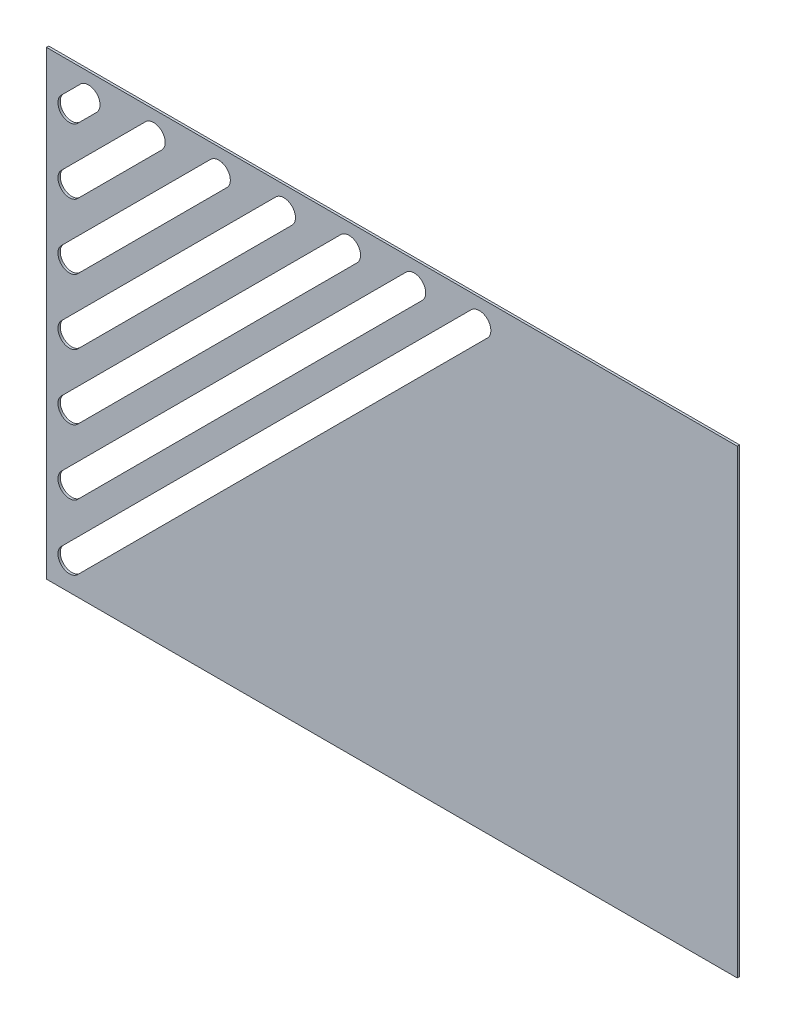
ISO-10303-21;
HEADER;
FILE_DESCRIPTION(('STEP AP214'),'2;1');
FILE_NAME('part.step','',(''),(''),'','','');
FILE_SCHEMA(('AUTOMOTIVE_DESIGN { 1 0 10303 214 1 1 1 1 }'));
ENDSEC;
DATA;
#1=APPLICATION_CONTEXT('core data for automotive mechanical design processes');
#2=APPLICATION_PROTOCOL_DEFINITION('international standard','automotive_design',2000,#1);
#3=PRODUCT_CONTEXT('',#1,'mechanical');
#4=PRODUCT('Part','Part','',(#3));
#5=PRODUCT_RELATED_PRODUCT_CATEGORY('part','',(#4));
#6=PRODUCT_DEFINITION_FORMATION('','',#4);
#7=PRODUCT_DEFINITION_CONTEXT('part definition',#1,'design');
#8=PRODUCT_DEFINITION('design','',#6,#7);
#9=PRODUCT_DEFINITION_SHAPE('','',#8);
#10=(LENGTH_UNIT() NAMED_UNIT(*) SI_UNIT(.MILLI.,.METRE.));
#11=(NAMED_UNIT(*) PLANE_ANGLE_UNIT() SI_UNIT($,.RADIAN.));
#12=(NAMED_UNIT(*) SI_UNIT($,.STERADIAN.) SOLID_ANGLE_UNIT());
#13=UNCERTAINTY_MEASURE_WITH_UNIT(LENGTH_MEASURE(1.E-05),#10,'distance_accuracy_value','');
#14=(GEOMETRIC_REPRESENTATION_CONTEXT(3) GLOBAL_UNCERTAINTY_ASSIGNED_CONTEXT((#13)) GLOBAL_UNIT_ASSIGNED_CONTEXT((#10,
#11,#12)) REPRESENTATION_CONTEXT('',''));
#15=CARTESIAN_POINT('',(0.,0.,0.));
#16=DIRECTION('',(0.,0.,1.));
#17=DIRECTION('',(1.,0.,0.));
#18=AXIS2_PLACEMENT_3D('',#15,#16,#17);
#19=CARTESIAN_POINT('',(0.,0.,-1.));
#20=DIRECTION('',(-1.,0.,0.));
#21=DIRECTION('',(0.,0.,1.));
#22=AXIS2_PLACEMENT_3D('',#19,#20,#21);
#23=PLANE('',#22);
#24=DIRECTION('',(0.,-1.,0.));
#25=VECTOR('',#24,1.);
#26=CARTESIAN_POINT('',(0.,0.,0.));
#27=LINE('',#26,#25);
#28=CARTESIAN_POINT('',(0.,200.,0.));
#29=VERTEX_POINT('',#28);
#30=CARTESIAN_POINT('',(0.,0.,0.));
#31=VERTEX_POINT('',#30);
#32=EDGE_CURVE('E453',#29,#31,#27,.T.);
#33=ORIENTED_EDGE('',*,*,#32,.F.);
#34=DIRECTION('',(0.,0.,1.));
#35=VECTOR('',#34,1.);
#36=CARTESIAN_POINT('',(0.,200.,-1.));
#37=LINE('',#36,#35);
#38=CARTESIAN_POINT('',(0.,200.,-1.));
#39=VERTEX_POINT('',#38);
#40=EDGE_CURVE('E11',#39,#29,#37,.T.);
#41=ORIENTED_EDGE('',*,*,#40,.F.);
#42=DIRECTION('',(0.,-1.,0.));
#43=VECTOR('',#42,1.);
#44=CARTESIAN_POINT('',(0.,0.,-1.));
#45=LINE('',#44,#43);
#46=CARTESIAN_POINT('',(0.,0.,-1.));
#47=VERTEX_POINT('',#46);
#48=EDGE_CURVE('E454',#39,#47,#45,.T.);
#49=ORIENTED_EDGE('',*,*,#48,.T.);
#50=DIRECTION('',(0.,0.,1.));
#51=VECTOR('',#50,1.);
#52=CARTESIAN_POINT('',(0.,0.,-1.));
#53=LINE('',#52,#51);
#54=EDGE_CURVE('E38',#47,#31,#53,.T.);
#55=ORIENTED_EDGE('',*,*,#54,.T.);
#56=EDGE_LOOP('',(#33,#41,#49,#55));
#57=FACE_BOUND('',#56,.T.);
#58=ADVANCED_FACE('F35',(#57),#23,.T.);
#59=CARTESIAN_POINT('',(0.,200.,-1.));
#60=DIRECTION('',(0.,1.,0.));
#61=DIRECTION('',(0.,0.,1.));
#62=AXIS2_PLACEMENT_3D('',#59,#60,#61);
#63=PLANE('',#62);
#64=DIRECTION('',(-1.,0.,0.));
#65=VECTOR('',#64,1.);
#66=CARTESIAN_POINT('',(0.,200.,0.));
#67=LINE('',#66,#65);
#68=CARTESIAN_POINT('',(300.,200.,0.));
#69=VERTEX_POINT('',#68);
#70=EDGE_CURVE('E458',#69,#29,#67,.T.);
#71=ORIENTED_EDGE('',*,*,#70,.F.);
#72=DIRECTION('',(0.,0.,1.));
#73=VECTOR('',#72,1.);
#74=CARTESIAN_POINT('',(300.,200.,-1.));
#75=LINE('',#74,#73);
#76=CARTESIAN_POINT('',(300.,200.,-1.));
#77=VERTEX_POINT('',#76);
#78=EDGE_CURVE('E43',#77,#69,#75,.T.);
#79=ORIENTED_EDGE('',*,*,#78,.F.);
#80=DIRECTION('',(-1.,0.,0.));
#81=VECTOR('',#80,1.);
#82=CARTESIAN_POINT('',(0.,200.,-1.));
#83=LINE('',#82,#81);
#84=EDGE_CURVE('E464',#77,#39,#83,.T.);
#85=ORIENTED_EDGE('',*,*,#84,.T.);
#86=ORIENTED_EDGE('',*,*,#40,.T.);
#87=EDGE_LOOP('',(#71,#79,#85,#86));
#88=FACE_BOUND('',#87,.T.);
#89=ADVANCED_FACE('F489',(#88),#63,.T.);
#90=CARTESIAN_POINT('',(300.,0.,-1.));
#91=DIRECTION('',(1.,0.,0.));
#92=DIRECTION('',(0.,0.,-1.));
#93=AXIS2_PLACEMENT_3D('',#90,#91,#92);
#94=PLANE('',#93);
#95=DIRECTION('',(0.,1.,0.));
#96=VECTOR('',#95,1.);
#97=CARTESIAN_POINT('',(300.,0.,0.));
#98=LINE('',#97,#96);
#99=CARTESIAN_POINT('',(300.,0.,0.));
#100=VERTEX_POINT('',#99);
#101=EDGE_CURVE('E472',#100,#69,#98,.T.);
#102=ORIENTED_EDGE('',*,*,#101,.F.);
#103=DIRECTION('',(0.,0.,1.));
#104=VECTOR('',#103,1.);
#105=CARTESIAN_POINT('',(300.,0.,-1.));
#106=LINE('',#105,#104);
#107=CARTESIAN_POINT('',(300.,0.,-1.));
#108=VERTEX_POINT('',#107);
#109=EDGE_CURVE('E477',#108,#100,#106,.T.);
#110=ORIENTED_EDGE('',*,*,#109,.F.);
#111=DIRECTION('',(0.,1.,0.));
#112=VECTOR('',#111,1.);
#113=CARTESIAN_POINT('',(300.,0.,-1.));
#114=LINE('',#113,#112);
#115=EDGE_CURVE('E461',#108,#77,#114,.T.);
#116=ORIENTED_EDGE('',*,*,#115,.T.);
#117=ORIENTED_EDGE('',*,*,#78,.T.);
#118=EDGE_LOOP('',(#102,#110,#116,#117));
#119=FACE_BOUND('',#118,.T.);
#120=ADVANCED_FACE('F495',(#119),#94,.T.);
#121=CARTESIAN_POINT('',(0.,0.,-1.));
#122=DIRECTION('',(0.,-1.,0.));
#123=DIRECTION('',(0.,0.,-1.));
#124=AXIS2_PLACEMENT_3D('',#121,#122,#123);
#125=PLANE('',#124);
#126=DIRECTION('',(1.,0.,0.));
#127=VECTOR('',#126,1.);
#128=CARTESIAN_POINT('',(0.,0.,0.));
#129=LINE('',#128,#127);
#130=EDGE_CURVE('E469',#31,#100,#129,.T.);
#131=ORIENTED_EDGE('',*,*,#130,.F.);
#132=ORIENTED_EDGE('',*,*,#54,.F.);
#133=DIRECTION('',(1.,0.,0.));
#134=VECTOR('',#133,1.);
#135=CARTESIAN_POINT('',(0.,0.,-1.));
#136=LINE('',#135,#134);
#137=EDGE_CURVE('E457',#47,#108,#136,.T.);
#138=ORIENTED_EDGE('',*,*,#137,.T.);
#139=ORIENTED_EDGE('',*,*,#109,.T.);
#140=EDGE_LOOP('',(#131,#132,#138,#139));
#141=FACE_BOUND('',#140,.T.);
#142=ADVANCED_FACE('F485',(#141),#125,.T.);
#143=CARTESIAN_POINT('',(0.,0.,-1.));
#144=DIRECTION('',(0.,0.,-1.));
#145=DIRECTION('',(-1.,0.,0.));
#146=AXIS2_PLACEMENT_3D('',#143,#144,#145);
#147=PLANE('',#146);
#148=CARTESIAN_POINT('',(10.,12.0101012677658,-0.999999999999999));
#149=DIRECTION('',(0.,0.,-1.));
#150=DIRECTION('',(-1.,0.,0.));
#151=AXIS2_PLACEMENT_3D('',#148,#149,#150);
#152=CIRCLE('',#151,4.99999999999997);
#153=CARTESIAN_POINT('',(13.5355339059328,8.47456736183317,-0.999999999999999));
#154=VERTEX_POINT('',#153);
#155=CARTESIAN_POINT('',(6.46446609406731,15.5456351736986,-0.999999999999999));
#156=VERTEX_POINT('',#155);
#157=EDGE_CURVE('E277',#154,#156,#152,.T.);
#158=ORIENTED_EDGE('',*,*,#157,.F.);
#159=DIRECTION('',(-0.707106781186544,-0.707106781186551,0.));
#160=VECTOR('',#159,1.);
#161=CARTESIAN_POINT('',(2.53048327204987,-2.53048327204985,-1.));
#162=LINE('',#161,#160);
#163=CARTESIAN_POINT('',(191.525432638165,186.464466094067,-1.));
#164=VERTEX_POINT('',#163);
#165=EDGE_CURVE('E270',#164,#154,#162,.T.);
#166=ORIENTED_EDGE('',*,*,#165,.F.);
#167=CARTESIAN_POINT('',(187.989898732232,190.,-0.999999999999999));
#168=DIRECTION('',(0.,0.,-1.));
#169=DIRECTION('',(-1.,0.,0.));
#170=AXIS2_PLACEMENT_3D('',#167,#168,#169);
#171=CIRCLE('',#170,4.99999999999996);
#172=CARTESIAN_POINT('',(184.4543648263,193.535533905933,-0.999999999999999));
#173=VERTEX_POINT('',#172);
#174=EDGE_CURVE('E250',#173,#164,#171,.T.);
#175=ORIENTED_EDGE('',*,*,#174,.F.);
#176=DIRECTION('',(0.707106781186544,0.707106781186551,0.));
#177=VECTOR('',#176,1.);
#178=CARTESIAN_POINT('',(-4.54058453981559,4.54058453981554,-1.));
#179=LINE('',#178,#177);
#180=EDGE_CURVE('E275',#156,#173,#179,.T.);
#181=ORIENTED_EDGE('',*,*,#180,.F.);
#182=EDGE_LOOP('',(#158,#166,#175,#181));
#183=FACE_BOUND('',#182,.T.);
#184=CARTESIAN_POINT('',(10.,40.2943725152279,-0.999999999999999));
#185=DIRECTION('',(0.,0.,-1.));
#186=DIRECTION('',(-1.,0.,0.));
#187=AXIS2_PLACEMENT_3D('',#184,#185,#186);
#188=CIRCLE('',#187,4.99999999999996);
#189=CARTESIAN_POINT('',(13.5355339059327,36.7588386092952,-0.999999999999999));
#190=VERTEX_POINT('',#189);
#191=CARTESIAN_POINT('',(6.46446609406728,43.8299064211606,-0.999999999999999));
#192=VERTEX_POINT('',#191);
#193=EDGE_CURVE('E306',#190,#192,#188,.T.);
#194=ORIENTED_EDGE('',*,*,#193,.F.);
#195=DIRECTION('',(-0.707106781186544,-0.707106781186551,0.));
#196=VECTOR('',#195,1.);
#197=CARTESIAN_POINT('',(-11.6116523516812,11.611652351681,-1.));
#198=LINE('',#197,#196);
#199=CARTESIAN_POINT('',(163.241161390703,186.464466094067,-1.));
#200=VERTEX_POINT('',#199);
#201=EDGE_CURVE('E293',#200,#190,#198,.T.);
#202=ORIENTED_EDGE('',*,*,#201,.F.);
#203=CARTESIAN_POINT('',(159.705627484771,190.,-0.999999999999999));
#204=DIRECTION('',(0.,0.,-1.));
#205=DIRECTION('',(-1.,0.,0.));
#206=AXIS2_PLACEMENT_3D('',#203,#204,#205);
#207=CIRCLE('',#206,4.99999999999996);
#208=CARTESIAN_POINT('',(156.170093578838,193.535533905933,-0.999999999999999));
#209=VERTEX_POINT('',#208);
#210=EDGE_CURVE('E301',#209,#200,#207,.T.);
#211=ORIENTED_EDGE('',*,*,#210,.F.);
#212=DIRECTION('',(0.707106781186544,0.707106781186551,0.));
#213=VECTOR('',#212,1.);
#214=CARTESIAN_POINT('',(-18.6827201635466,18.6827201635464,-1.));
#215=LINE('',#214,#213);
#216=EDGE_CURVE('E304',#192,#209,#215,.T.);
#217=ORIENTED_EDGE('',*,*,#216,.F.);
#218=EDGE_LOOP('',(#194,#202,#211,#217));
#219=FACE_BOUND('',#218,.T.);
#220=CARTESIAN_POINT('',(10.,68.5786437626899,-0.999999999999999));
#221=DIRECTION('',(0.,0.,-1.));
#222=DIRECTION('',(-1.,0.,0.));
#223=AXIS2_PLACEMENT_3D('',#220,#221,#222);
#224=CIRCLE('',#223,4.99999999999998);
#225=CARTESIAN_POINT('',(13.5355339059327,65.0431098567572,-0.999999999999999));
#226=VERTEX_POINT('',#225);
#227=CARTESIAN_POINT('',(6.46446609406725,72.1141776686226,-0.999999999999999));
#228=VERTEX_POINT('',#227);
#229=EDGE_CURVE('E335',#226,#228,#224,.T.);
#230=ORIENTED_EDGE('',*,*,#229,.F.);
#231=DIRECTION('',(-0.707106781186544,-0.707106781186551,0.));
#232=VECTOR('',#231,1.);
#233=CARTESIAN_POINT('',(-25.7537879754122,25.7537879754119,-1.));
#234=LINE('',#233,#232);
#235=CARTESIAN_POINT('',(134.956890143242,186.464466094067,-1.));
#236=VERTEX_POINT('',#235);
#237=EDGE_CURVE('E322',#236,#226,#234,.T.);
#238=ORIENTED_EDGE('',*,*,#237,.F.);
#239=CARTESIAN_POINT('',(131.421356237309,190.,-0.999999999999999));
#240=DIRECTION('',(0.,0.,-1.));
#241=DIRECTION('',(-1.,0.,0.));
#242=AXIS2_PLACEMENT_3D('',#239,#240,#241);
#243=CIRCLE('',#242,4.99999999999998);
#244=CARTESIAN_POINT('',(127.885822331376,193.535533905933,-0.999999999999999));
#245=VERTEX_POINT('',#244);
#246=EDGE_CURVE('E330',#245,#236,#243,.T.);
#247=ORIENTED_EDGE('',*,*,#246,.F.);
#248=DIRECTION('',(0.707106781186544,0.707106781186551,0.));
#249=VECTOR('',#248,1.);
#250=CARTESIAN_POINT('',(-32.8248557872776,32.8248557872773,-1.));
#251=LINE('',#250,#249);
#252=EDGE_CURVE('E333',#228,#245,#251,.T.);
#253=ORIENTED_EDGE('',*,*,#252,.F.);
#254=EDGE_LOOP('',(#230,#238,#247,#253));
#255=FACE_BOUND('',#254,.T.);
#256=CARTESIAN_POINT('',(10.,96.8629150101519,-0.999999999999999));
#257=DIRECTION('',(0.,0.,-1.));
#258=DIRECTION('',(-1.,0.,0.));
#259=AXIS2_PLACEMENT_3D('',#256,#257,#258);
#260=CIRCLE('',#259,4.99999999999996);
#261=CARTESIAN_POINT('',(13.5355339059328,93.3273811042193,-0.999999999999999));
#262=VERTEX_POINT('',#261);
#263=CARTESIAN_POINT('',(6.46446609406735,100.398448916085,-0.999999999999999));
#264=VERTEX_POINT('',#263);
#265=EDGE_CURVE('E364',#262,#264,#260,.T.);
#266=ORIENTED_EDGE('',*,*,#265,.F.);
#267=DIRECTION('',(-0.707106781186544,-0.707106781186551,0.));
#268=VECTOR('',#267,1.);
#269=CARTESIAN_POINT('',(-39.8959235991432,39.8959235991427,-1.));
#270=LINE('',#269,#268);
#271=CARTESIAN_POINT('',(106.67261889578,186.464466094067,-1.));
#272=VERTEX_POINT('',#271);
#273=EDGE_CURVE('E351',#272,#262,#270,.T.);
#274=ORIENTED_EDGE('',*,*,#273,.F.);
#275=CARTESIAN_POINT('',(103.137084989847,190.,-0.999999999999999));
#276=DIRECTION('',(0.,0.,-1.));
#277=DIRECTION('',(-1.,0.,0.));
#278=AXIS2_PLACEMENT_3D('',#275,#276,#277);
#279=CIRCLE('',#278,4.99999999999997);
#280=CARTESIAN_POINT('',(99.6015510839143,193.535533905933,-0.999999999999999));
#281=VERTEX_POINT('',#280);
#282=EDGE_CURVE('E359',#281,#272,#279,.T.);
#283=ORIENTED_EDGE('',*,*,#282,.F.);
#284=DIRECTION('',(0.707106781186544,0.707106781186551,0.));
#285=VECTOR('',#284,1.);
#286=CARTESIAN_POINT('',(-46.9669914110086,46.9669914110081,-1.));
#287=LINE('',#286,#285);
#288=EDGE_CURVE('E362',#264,#281,#287,.T.);
#289=ORIENTED_EDGE('',*,*,#288,.F.);
#290=EDGE_LOOP('',(#266,#274,#283,#289));
#291=FACE_BOUND('',#290,.T.);
#292=CARTESIAN_POINT('',(10.,125.147186257614,-0.999999999999999));
#293=DIRECTION('',(0.,0.,-1.));
#294=DIRECTION('',(-1.,0.,0.));
#295=AXIS2_PLACEMENT_3D('',#292,#293,#294);
#296=CIRCLE('',#295,4.99999999999996);
#297=CARTESIAN_POINT('',(13.5355339059328,121.611652351681,-0.999999999999999));
#298=VERTEX_POINT('',#297);
#299=CARTESIAN_POINT('',(6.46446609406735,128.682720163547,-0.999999999999999));
#300=VERTEX_POINT('',#299);
#301=EDGE_CURVE('E393',#298,#300,#296,.T.);
#302=ORIENTED_EDGE('',*,*,#301,.F.);
#303=DIRECTION('',(-0.707106781186544,-0.707106781186551,0.));
#304=VECTOR('',#303,1.);
#305=CARTESIAN_POINT('',(-54.0380592228742,54.0380592228737,-1.));
#306=LINE('',#305,#304);
#307=CARTESIAN_POINT('',(78.388347648318,186.464466094067,-1.));
#308=VERTEX_POINT('',#307);
#309=EDGE_CURVE('E380',#308,#298,#306,.T.);
#310=ORIENTED_EDGE('',*,*,#309,.F.);
#311=CARTESIAN_POINT('',(74.8528137423854,190.,-0.999999999999999));
#312=DIRECTION('',(0.,0.,-1.));
#313=DIRECTION('',(-1.,0.,0.));
#314=AXIS2_PLACEMENT_3D('',#311,#312,#313);
#315=CIRCLE('',#314,4.99999999999997);
#316=CARTESIAN_POINT('',(71.3172798364526,193.535533905933,-0.999999999999999));
#317=VERTEX_POINT('',#316);
#318=EDGE_CURVE('E388',#317,#308,#315,.T.);
#319=ORIENTED_EDGE('',*,*,#318,.F.);
#320=DIRECTION('',(0.707106781186544,0.707106781186551,0.));
#321=VECTOR('',#320,1.);
#322=CARTESIAN_POINT('',(-61.1091270347397,61.109127034739,-1.));
#323=LINE('',#322,#321);
#324=EDGE_CURVE('E391',#300,#317,#323,.T.);
#325=ORIENTED_EDGE('',*,*,#324,.F.);
#326=EDGE_LOOP('',(#302,#310,#319,#325));
#327=FACE_BOUND('',#326,.T.);
#328=CARTESIAN_POINT('',(10.,153.431457505076,-0.999999999999999));
#329=DIRECTION('',(0.,0.,-1.));
#330=DIRECTION('',(-1.,0.,0.));
#331=AXIS2_PLACEMENT_3D('',#328,#329,#330);
#332=CIRCLE('',#331,4.99999999999995);
#333=CARTESIAN_POINT('',(13.5355339059328,149.895923599143,-0.999999999999999));
#334=VERTEX_POINT('',#333);
#335=CARTESIAN_POINT('',(6.46446609406738,156.966991411009,-0.999999999999999));
#336=VERTEX_POINT('',#335);
#337=EDGE_CURVE('E422',#334,#336,#332,.T.);
#338=ORIENTED_EDGE('',*,*,#337,.F.);
#339=DIRECTION('',(-0.707106781186543,-0.707106781186552,0.));
#340=VECTOR('',#339,1.);
#341=CARTESIAN_POINT('',(-68.1801948466052,68.1801948466045,-1.));
#342=LINE('',#341,#340);
#343=CARTESIAN_POINT('',(50.1040764008563,186.464466094067,-1.));
#344=VERTEX_POINT('',#343);
#345=EDGE_CURVE('E409',#344,#334,#342,.T.);
#346=ORIENTED_EDGE('',*,*,#345,.F.);
#347=CARTESIAN_POINT('',(46.5685424949236,190.,-0.999999999999999));
#348=DIRECTION('',(0.,0.,-1.));
#349=DIRECTION('',(-1.,0.,0.));
#350=AXIS2_PLACEMENT_3D('',#347,#348,#349);
#351=CIRCLE('',#350,4.99999999999994);
#352=CARTESIAN_POINT('',(43.0330085889909,193.535533905933,-0.999999999999999));
#353=VERTEX_POINT('',#352);
#354=EDGE_CURVE('E417',#353,#344,#351,.T.);
#355=ORIENTED_EDGE('',*,*,#354,.F.);
#356=DIRECTION('',(0.707106781186544,0.707106781186551,0.));
#357=VECTOR('',#356,1.);
#358=CARTESIAN_POINT('',(-75.2512626584707,75.2512626584699,-1.));
#359=LINE('',#358,#357);
#360=EDGE_CURVE('E420',#336,#353,#359,.T.);
#361=ORIENTED_EDGE('',*,*,#360,.F.);
#362=EDGE_LOOP('',(#338,#346,#355,#361));
#363=FACE_BOUND('',#362,.T.);
#364=CARTESIAN_POINT('',(10.,181.715728752538,-0.999999999999999));
#365=DIRECTION('',(0.,0.,-1.));
#366=DIRECTION('',(-1.,0.,0.));
#367=AXIS2_PLACEMENT_3D('',#364,#365,#366);
#368=CIRCLE('',#367,5.);
#369=CARTESIAN_POINT('',(13.5355339059327,178.180194846605,-0.999999999999999));
#370=VERTEX_POINT('',#369);
#371=CARTESIAN_POINT('',(6.46446609406722,185.251262658471,-0.999999999999999));
#372=VERTEX_POINT('',#371);
#373=EDGE_CURVE('E451',#370,#372,#368,.T.);
#374=ORIENTED_EDGE('',*,*,#373,.F.);
#375=DIRECTION('',(-0.707106781186545,-0.70710678118655,0.));
#376=VECTOR('',#375,1.);
#377=CARTESIAN_POINT('',(-82.3223304703363,82.3223304703358,-1.));
#378=LINE('',#377,#376);
#379=CARTESIAN_POINT('',(21.8198051533946,186.464466094067,-1.));
#380=VERTEX_POINT('',#379);
#381=EDGE_CURVE('E438',#380,#370,#378,.T.);
#382=ORIENTED_EDGE('',*,*,#381,.F.);
#383=CARTESIAN_POINT('',(18.2842712474619,190.,-0.999999999999999));
#384=DIRECTION('',(0.,0.,-1.));
#385=DIRECTION('',(-1.,0.,0.));
#386=AXIS2_PLACEMENT_3D('',#383,#384,#385);
#387=CIRCLE('',#386,5.);
#388=CARTESIAN_POINT('',(14.7487373415291,193.535533905933,-0.999999999999999));
#389=VERTEX_POINT('',#388);
#390=EDGE_CURVE('E446',#389,#380,#387,.T.);
#391=ORIENTED_EDGE('',*,*,#390,.F.);
#392=DIRECTION('',(0.707106781186545,0.70710678118655,0.));
#393=VECTOR('',#392,1.);
#394=CARTESIAN_POINT('',(-89.3933982822018,89.3933982822012,-1.));
#395=LINE('',#394,#393);
#396=EDGE_CURVE('E449',#372,#389,#395,.T.);
#397=ORIENTED_EDGE('',*,*,#396,.F.);
#398=EDGE_LOOP('',(#374,#382,#391,#397));
#399=FACE_BOUND('',#398,.T.);
#400=ORIENTED_EDGE('',*,*,#48,.F.);
#401=ORIENTED_EDGE('',*,*,#84,.F.);
#402=ORIENTED_EDGE('',*,*,#115,.F.);
#403=ORIENTED_EDGE('',*,*,#137,.F.);
#404=EDGE_LOOP('',(#400,#401,#402,#403));
#405=FACE_BOUND('',#404,.T.);
#406=ADVANCED_FACE('F492',(#183,#219,#255,#291,#327,#363,#399,#405),#147,.T.);
#407=CARTESIAN_POINT('',(0.,0.,0.));
#408=DIRECTION('',(0.,0.,-1.));
#409=DIRECTION('',(-1.,0.,0.));
#410=AXIS2_PLACEMENT_3D('',#407,#408,#409);
#411=PLANE('',#410);
#412=DIRECTION('',(0.707106781186544,0.707106781186551,0.));
#413=VECTOR('',#412,1.);
#414=CARTESIAN_POINT('',(13.5355339059328,8.47456736183317,0.));
#415=LINE('',#414,#413);
#416=CARTESIAN_POINT('',(13.5355339059328,8.47456736183317,0.));
#417=VERTEX_POINT('',#416);
#418=CARTESIAN_POINT('',(191.525432638165,186.464466094067,0.));
#419=VERTEX_POINT('',#418);
#420=EDGE_CURVE('E256',#417,#419,#415,.T.);
#421=ORIENTED_EDGE('',*,*,#420,.F.);
#422=CARTESIAN_POINT('',(10.,12.0101012677658,0.));
#423=DIRECTION('',(0.,0.,1.));
#424=DIRECTION('',(1.,0.,0.));
#425=AXIS2_PLACEMENT_3D('',#422,#423,#424);
#426=CIRCLE('',#425,4.99999999999997);
#427=CARTESIAN_POINT('',(6.46446609406731,15.5456351736986,0.));
#428=VERTEX_POINT('',#427);
#429=EDGE_CURVE('E59',#428,#417,#426,.T.);
#430=ORIENTED_EDGE('',*,*,#429,.F.);
#431=DIRECTION('',(-0.707106781186544,-0.707106781186551,0.));
#432=VECTOR('',#431,1.);
#433=CARTESIAN_POINT('',(6.46446609406731,15.5456351736986,0.));
#434=LINE('',#433,#432);
#435=CARTESIAN_POINT('',(184.4543648263,193.535533905933,0.));
#436=VERTEX_POINT('',#435);
#437=EDGE_CURVE('E263',#436,#428,#434,.T.);
#438=ORIENTED_EDGE('',*,*,#437,.F.);
#439=CARTESIAN_POINT('',(187.989898732232,190.,0.));
#440=DIRECTION('',(0.,0.,1.));
#441=DIRECTION('',(1.,0.,0.));
#442=AXIS2_PLACEMENT_3D('',#439,#440,#441);
#443=CIRCLE('',#442,4.99999999999996);
#444=EDGE_CURVE('E247',#419,#436,#443,.T.);
#445=ORIENTED_EDGE('',*,*,#444,.F.);
#446=EDGE_LOOP('',(#421,#430,#438,#445));
#447=FACE_BOUND('',#446,.T.);
#448=DIRECTION('',(0.707106781186544,0.707106781186551,0.));
#449=VECTOR('',#448,1.);
#450=CARTESIAN_POINT('',(13.5355339059327,36.7588386092952,0.));
#451=LINE('',#450,#449);
#452=CARTESIAN_POINT('',(13.5355339059327,36.7588386092952,0.));
#453=VERTEX_POINT('',#452);
#454=CARTESIAN_POINT('',(163.241161390703,186.464466094067,0.));
#455=VERTEX_POINT('',#454);
#456=EDGE_CURVE('E281',#453,#455,#451,.T.);
#457=ORIENTED_EDGE('',*,*,#456,.F.);
#458=CARTESIAN_POINT('',(10.,40.2943725152279,0.));
#459=DIRECTION('',(0.,0.,1.));
#460=DIRECTION('',(1.,0.,0.));
#461=AXIS2_PLACEMENT_3D('',#458,#459,#460);
#462=CIRCLE('',#461,4.99999999999996);
#463=CARTESIAN_POINT('',(6.46446609406728,43.8299064211606,0.));
#464=VERTEX_POINT('',#463);
#465=EDGE_CURVE('E279',#464,#453,#462,.T.);
#466=ORIENTED_EDGE('',*,*,#465,.F.);
#467=DIRECTION('',(-0.707106781186544,-0.707106781186551,0.));
#468=VECTOR('',#467,1.);
#469=CARTESIAN_POINT('',(6.46446609406728,43.8299064211606,0.));
#470=LINE('',#469,#468);
#471=CARTESIAN_POINT('',(156.170093578838,193.535533905933,0.));
#472=VERTEX_POINT('',#471);
#473=EDGE_CURVE('E287',#472,#464,#470,.T.);
#474=ORIENTED_EDGE('',*,*,#473,.F.);
#475=CARTESIAN_POINT('',(159.705627484771,190.,0.));
#476=DIRECTION('',(0.,0.,1.));
#477=DIRECTION('',(1.,0.,0.));
#478=AXIS2_PLACEMENT_3D('',#475,#476,#477);
#479=CIRCLE('',#478,4.99999999999996);
#480=EDGE_CURVE('E284',#455,#472,#479,.T.);
#481=ORIENTED_EDGE('',*,*,#480,.F.);
#482=EDGE_LOOP('',(#457,#466,#474,#481));
#483=FACE_BOUND('',#482,.T.);
#484=DIRECTION('',(0.707106781186544,0.707106781186551,0.));
#485=VECTOR('',#484,1.);
#486=CARTESIAN_POINT('',(13.5355339059327,65.0431098567572,0.));
#487=LINE('',#486,#485);
#488=CARTESIAN_POINT('',(13.5355339059327,65.0431098567572,0.));
#489=VERTEX_POINT('',#488);
#490=CARTESIAN_POINT('',(134.956890143242,186.464466094067,0.));
#491=VERTEX_POINT('',#490);
#492=EDGE_CURVE('E310',#489,#491,#487,.T.);
#493=ORIENTED_EDGE('',*,*,#492,.F.);
#494=CARTESIAN_POINT('',(10.,68.5786437626899,0.));
#495=DIRECTION('',(0.,0.,1.));
#496=DIRECTION('',(1.,0.,0.));
#497=AXIS2_PLACEMENT_3D('',#494,#495,#496);
#498=CIRCLE('',#497,4.99999999999998);
#499=CARTESIAN_POINT('',(6.46446609406725,72.1141776686226,0.));
#500=VERTEX_POINT('',#499);
#501=EDGE_CURVE('E308',#500,#489,#498,.T.);
#502=ORIENTED_EDGE('',*,*,#501,.F.);
#503=DIRECTION('',(-0.707106781186544,-0.707106781186551,0.));
#504=VECTOR('',#503,1.);
#505=CARTESIAN_POINT('',(6.46446609406725,72.1141776686226,0.));
#506=LINE('',#505,#504);
#507=CARTESIAN_POINT('',(127.885822331376,193.535533905933,0.));
#508=VERTEX_POINT('',#507);
#509=EDGE_CURVE('E316',#508,#500,#506,.T.);
#510=ORIENTED_EDGE('',*,*,#509,.F.);
#511=CARTESIAN_POINT('',(131.421356237309,190.,0.));
#512=DIRECTION('',(0.,0.,1.));
#513=DIRECTION('',(1.,0.,0.));
#514=AXIS2_PLACEMENT_3D('',#511,#512,#513);
#515=CIRCLE('',#514,4.99999999999998);
#516=EDGE_CURVE('E313',#491,#508,#515,.T.);
#517=ORIENTED_EDGE('',*,*,#516,.F.);
#518=EDGE_LOOP('',(#493,#502,#510,#517));
#519=FACE_BOUND('',#518,.T.);
#520=DIRECTION('',(0.707106781186544,0.707106781186551,0.));
#521=VECTOR('',#520,1.);
#522=CARTESIAN_POINT('',(13.5355339059328,93.3273811042193,0.));
#523=LINE('',#522,#521);
#524=CARTESIAN_POINT('',(13.5355339059328,93.3273811042193,0.));
#525=VERTEX_POINT('',#524);
#526=CARTESIAN_POINT('',(106.67261889578,186.464466094067,0.));
#527=VERTEX_POINT('',#526);
#528=EDGE_CURVE('E339',#525,#527,#523,.T.);
#529=ORIENTED_EDGE('',*,*,#528,.F.);
#530=CARTESIAN_POINT('',(10.,96.8629150101519,0.));
#531=DIRECTION('',(0.,0.,1.));
#532=DIRECTION('',(1.,0.,0.));
#533=AXIS2_PLACEMENT_3D('',#530,#531,#532);
#534=CIRCLE('',#533,4.99999999999996);
#535=CARTESIAN_POINT('',(6.46446609406735,100.398448916085,0.));
#536=VERTEX_POINT('',#535);
#537=EDGE_CURVE('E337',#536,#525,#534,.T.);
#538=ORIENTED_EDGE('',*,*,#537,.F.);
#539=DIRECTION('',(-0.707106781186544,-0.707106781186551,0.));
#540=VECTOR('',#539,1.);
#541=CARTESIAN_POINT('',(6.46446609406735,100.398448916085,0.));
#542=LINE('',#541,#540);
#543=CARTESIAN_POINT('',(99.6015510839143,193.535533905933,0.));
#544=VERTEX_POINT('',#543);
#545=EDGE_CURVE('E345',#544,#536,#542,.T.);
#546=ORIENTED_EDGE('',*,*,#545,.F.);
#547=CARTESIAN_POINT('',(103.137084989847,190.,0.));
#548=DIRECTION('',(0.,0.,1.));
#549=DIRECTION('',(1.,0.,0.));
#550=AXIS2_PLACEMENT_3D('',#547,#548,#549);
#551=CIRCLE('',#550,4.99999999999997);
#552=EDGE_CURVE('E342',#527,#544,#551,.T.);
#553=ORIENTED_EDGE('',*,*,#552,.F.);
#554=EDGE_LOOP('',(#529,#538,#546,#553));
#555=FACE_BOUND('',#554,.T.);
#556=DIRECTION('',(0.707106781186544,0.707106781186551,0.));
#557=VECTOR('',#556,1.);
#558=CARTESIAN_POINT('',(13.5355339059328,121.611652351681,0.));
#559=LINE('',#558,#557);
#560=CARTESIAN_POINT('',(13.5355339059328,121.611652351681,0.));
#561=VERTEX_POINT('',#560);
#562=CARTESIAN_POINT('',(78.3883476483181,186.464466094067,0.));
#563=VERTEX_POINT('',#562);
#564=EDGE_CURVE('E368',#561,#563,#559,.T.);
#565=ORIENTED_EDGE('',*,*,#564,.F.);
#566=CARTESIAN_POINT('',(10.,125.147186257614,0.));
#567=DIRECTION('',(0.,0.,1.));
#568=DIRECTION('',(1.,0.,0.));
#569=AXIS2_PLACEMENT_3D('',#566,#567,#568);
#570=CIRCLE('',#569,4.99999999999996);
#571=CARTESIAN_POINT('',(6.46446609406735,128.682720163547,0.));
#572=VERTEX_POINT('',#571);
#573=EDGE_CURVE('E366',#572,#561,#570,.T.);
#574=ORIENTED_EDGE('',*,*,#573,.F.);
#575=DIRECTION('',(-0.707106781186544,-0.707106781186551,0.));
#576=VECTOR('',#575,1.);
#577=CARTESIAN_POINT('',(6.46446609406735,128.682720163547,0.));
#578=LINE('',#577,#576);
#579=CARTESIAN_POINT('',(71.3172798364526,193.535533905933,0.));
#580=VERTEX_POINT('',#579);
#581=EDGE_CURVE('E374',#580,#572,#578,.T.);
#582=ORIENTED_EDGE('',*,*,#581,.F.);
#583=CARTESIAN_POINT('',(74.8528137423854,190.,0.));
#584=DIRECTION('',(0.,0.,1.));
#585=DIRECTION('',(1.,0.,0.));
#586=AXIS2_PLACEMENT_3D('',#583,#584,#585);
#587=CIRCLE('',#586,4.99999999999997);
#588=EDGE_CURVE('E371',#563,#580,#587,.T.);
#589=ORIENTED_EDGE('',*,*,#588,.F.);
#590=EDGE_LOOP('',(#565,#574,#582,#589));
#591=FACE_BOUND('',#590,.T.);
#592=DIRECTION('',(0.707106781186543,0.707106781186552,0.));
#593=VECTOR('',#592,1.);
#594=CARTESIAN_POINT('',(13.5355339059328,149.895923599143,0.));
#595=LINE('',#594,#593);
#596=CARTESIAN_POINT('',(13.5355339059328,149.895923599143,0.));
#597=VERTEX_POINT('',#596);
#598=CARTESIAN_POINT('',(50.1040764008564,186.464466094067,0.));
#599=VERTEX_POINT('',#598);
#600=EDGE_CURVE('E397',#597,#599,#595,.T.);
#601=ORIENTED_EDGE('',*,*,#600,.F.);
#602=CARTESIAN_POINT('',(10.,153.431457505076,0.));
#603=DIRECTION('',(0.,0.,1.));
#604=DIRECTION('',(1.,0.,0.));
#605=AXIS2_PLACEMENT_3D('',#602,#603,#604);
#606=CIRCLE('',#605,4.99999999999995);
#607=CARTESIAN_POINT('',(6.46446609406738,156.966991411009,0.));
#608=VERTEX_POINT('',#607);
#609=EDGE_CURVE('E395',#608,#597,#606,.T.);
#610=ORIENTED_EDGE('',*,*,#609,.F.);
#611=DIRECTION('',(-0.707106781186544,-0.707106781186551,0.));
#612=VECTOR('',#611,1.);
#613=CARTESIAN_POINT('',(6.46446609406738,156.966991411009,0.));
#614=LINE('',#613,#612);
#615=CARTESIAN_POINT('',(43.0330085889909,193.535533905933,0.));
#616=VERTEX_POINT('',#615);
#617=EDGE_CURVE('E403',#616,#608,#614,.T.);
#618=ORIENTED_EDGE('',*,*,#617,.F.);
#619=CARTESIAN_POINT('',(46.5685424949236,190.,0.));
#620=DIRECTION('',(0.,0.,1.));
#621=DIRECTION('',(1.,0.,0.));
#622=AXIS2_PLACEMENT_3D('',#619,#620,#621);
#623=CIRCLE('',#622,4.99999999999994);
#624=EDGE_CURVE('E400',#599,#616,#623,.T.);
#625=ORIENTED_EDGE('',*,*,#624,.F.);
#626=EDGE_LOOP('',(#601,#610,#618,#625));
#627=FACE_BOUND('',#626,.T.);
#628=DIRECTION('',(0.707106781186545,0.70710678118655,0.));
#629=VECTOR('',#628,1.);
#630=CARTESIAN_POINT('',(13.5355339059327,178.180194846605,0.));
#631=LINE('',#630,#629);
#632=CARTESIAN_POINT('',(13.5355339059327,178.180194846605,0.));
#633=VERTEX_POINT('',#632);
#634=CARTESIAN_POINT('',(21.8198051533946,186.464466094067,0.));
#635=VERTEX_POINT('',#634);
#636=EDGE_CURVE('E426',#633,#635,#631,.T.);
#637=ORIENTED_EDGE('',*,*,#636,.F.);
#638=CARTESIAN_POINT('',(10.,181.715728752538,0.));
#639=DIRECTION('',(0.,0.,1.));
#640=DIRECTION('',(1.,0.,0.));
#641=AXIS2_PLACEMENT_3D('',#638,#639,#640);
#642=CIRCLE('',#641,5.);
#643=CARTESIAN_POINT('',(6.46446609406722,185.251262658471,0.));
#644=VERTEX_POINT('',#643);
#645=EDGE_CURVE('E424',#644,#633,#642,.T.);
#646=ORIENTED_EDGE('',*,*,#645,.F.);
#647=DIRECTION('',(-0.707106781186545,-0.70710678118655,0.));
#648=VECTOR('',#647,1.);
#649=CARTESIAN_POINT('',(6.46446609406722,185.251262658471,0.));
#650=LINE('',#649,#648);
#651=CARTESIAN_POINT('',(14.7487373415291,193.535533905933,0.));
#652=VERTEX_POINT('',#651);
#653=EDGE_CURVE('E432',#652,#644,#650,.T.);
#654=ORIENTED_EDGE('',*,*,#653,.F.);
#655=CARTESIAN_POINT('',(18.2842712474619,190.,0.));
#656=DIRECTION('',(0.,0.,1.));
#657=DIRECTION('',(1.,0.,0.));
#658=AXIS2_PLACEMENT_3D('',#655,#656,#657);
#659=CIRCLE('',#658,5.);
#660=EDGE_CURVE('E429',#635,#652,#659,.T.);
#661=ORIENTED_EDGE('',*,*,#660,.F.);
#662=EDGE_LOOP('',(#637,#646,#654,#661));
#663=FACE_BOUND('',#662,.T.);
#664=ORIENTED_EDGE('',*,*,#32,.T.);
#665=ORIENTED_EDGE('',*,*,#130,.T.);
#666=ORIENTED_EDGE('',*,*,#101,.T.);
#667=ORIENTED_EDGE('',*,*,#70,.T.);
#668=EDGE_LOOP('',(#664,#665,#666,#667));
#669=FACE_BOUND('',#668,.T.);
#670=ADVANCED_FACE('F260',(#447,#483,#519,#555,#591,#627,#663,#669),#411,.F.);
#671=CARTESIAN_POINT('',(10.,181.715728752538,-10.));
#672=DIRECTION('',(0.,0.,1.));
#673=DIRECTION('',(1.,0.,0.));
#674=AXIS2_PLACEMENT_3D('',#671,#672,#673);
#675=CYLINDRICAL_SURFACE('',#674,5.);
#676=ORIENTED_EDGE('',*,*,#373,.T.);
#677=DIRECTION('',(0.,0.,1.));
#678=VECTOR('',#677,1.);
#679=CARTESIAN_POINT('',(6.46446609406722,185.251262658471,-10.));
#680=LINE('',#679,#678);
#681=EDGE_CURVE('E436',#372,#644,#680,.T.);
#682=ORIENTED_EDGE('',*,*,#681,.T.);
#683=ORIENTED_EDGE('',*,*,#645,.T.);
#684=DIRECTION('',(0.,0.,1.));
#685=VECTOR('',#684,1.);
#686=CARTESIAN_POINT('',(13.5355339059327,178.180194846605,-10.));
#687=LINE('',#686,#685);
#688=EDGE_CURVE('E435',#370,#633,#687,.T.);
#689=ORIENTED_EDGE('',*,*,#688,.F.);
#690=EDGE_LOOP('',(#676,#682,#683,#689));
#691=FACE_BOUND('',#690,.T.);
#692=ADVANCED_FACE('F530',(#691),#675,.F.);
#693=CARTESIAN_POINT('',(6.46446609406722,185.251262658471,-10.));
#694=DIRECTION('',(-0.70710678118655,0.707106781186545,0.));
#695=DIRECTION('',(-0.707106781186545,-0.70710678118655,0.));
#696=AXIS2_PLACEMENT_3D('',#693,#694,#695);
#697=PLANE('',#696);
#698=ORIENTED_EDGE('',*,*,#396,.T.);
#699=DIRECTION('',(0.,0.,1.));
#700=VECTOR('',#699,1.);
#701=CARTESIAN_POINT('',(14.7487373415291,193.535533905933,-10.));
#702=LINE('',#701,#700);
#703=EDGE_CURVE('E439',#389,#652,#702,.T.);
#704=ORIENTED_EDGE('',*,*,#703,.T.);
#705=ORIENTED_EDGE('',*,*,#653,.T.);
#706=ORIENTED_EDGE('',*,*,#681,.F.);
#707=EDGE_LOOP('',(#698,#704,#705,#706));
#708=FACE_BOUND('',#707,.T.);
#709=ADVANCED_FACE('F535',(#708),#697,.F.);
#710=CARTESIAN_POINT('',(18.2842712474619,190.,-10.));
#711=DIRECTION('',(0.,0.,1.));
#712=DIRECTION('',(1.,0.,0.));
#713=AXIS2_PLACEMENT_3D('',#710,#711,#712);
#714=CYLINDRICAL_SURFACE('',#713,5.);
#715=ORIENTED_EDGE('',*,*,#390,.T.);
#716=DIRECTION('',(0.,0.,1.));
#717=VECTOR('',#716,1.);
#718=CARTESIAN_POINT('',(21.8198051533946,186.464466094067,-10.));
#719=LINE('',#718,#717);
#720=EDGE_CURVE('E441',#380,#635,#719,.T.);
#721=ORIENTED_EDGE('',*,*,#720,.T.);
#722=ORIENTED_EDGE('',*,*,#660,.T.);
#723=ORIENTED_EDGE('',*,*,#703,.F.);
#724=EDGE_LOOP('',(#715,#721,#722,#723));
#725=FACE_BOUND('',#724,.T.);
#726=ADVANCED_FACE('F548',(#725),#714,.F.);
#727=CARTESIAN_POINT('',(13.5355339059327,178.180194846605,-10.));
#728=DIRECTION('',(0.70710678118655,-0.707106781186545,0.));
#729=DIRECTION('',(0.707106781186545,0.70710678118655,0.));
#730=AXIS2_PLACEMENT_3D('',#727,#728,#729);
#731=PLANE('',#730);
#732=ORIENTED_EDGE('',*,*,#381,.T.);
#733=ORIENTED_EDGE('',*,*,#688,.T.);
#734=ORIENTED_EDGE('',*,*,#636,.T.);
#735=ORIENTED_EDGE('',*,*,#720,.F.);
#736=EDGE_LOOP('',(#732,#733,#734,#735));
#737=FACE_BOUND('',#736,.T.);
#738=ADVANCED_FACE('F559',(#737),#731,.F.);
#739=CARTESIAN_POINT('',(10.,153.431457505076,-10.));
#740=DIRECTION('',(0.,0.,1.));
#741=DIRECTION('',(1.,0.,0.));
#742=AXIS2_PLACEMENT_3D('',#739,#740,#741);
#743=CYLINDRICAL_SURFACE('',#742,4.99999999999995);
#744=ORIENTED_EDGE('',*,*,#337,.T.);
#745=DIRECTION('',(0.,0.,1.));
#746=VECTOR('',#745,1.);
#747=CARTESIAN_POINT('',(6.46446609406738,156.966991411009,-10.));
#748=LINE('',#747,#746);
#749=EDGE_CURVE('E407',#336,#608,#748,.T.);
#750=ORIENTED_EDGE('',*,*,#749,.T.);
#751=ORIENTED_EDGE('',*,*,#609,.T.);
#752=DIRECTION('',(0.,0.,1.));
#753=VECTOR('',#752,1.);
#754=CARTESIAN_POINT('',(13.5355339059328,149.895923599143,-10.));
#755=LINE('',#754,#753);
#756=EDGE_CURVE('E406',#334,#597,#755,.T.);
#757=ORIENTED_EDGE('',*,*,#756,.F.);
#758=EDGE_LOOP('',(#744,#750,#751,#757));
#759=FACE_BOUND('',#758,.T.);
#760=ADVANCED_FACE('F570',(#759),#743,.F.);
#761=CARTESIAN_POINT('',(6.46446609406738,156.966991411009,-10.));
#762=DIRECTION('',(-0.707106781186551,0.707106781186544,0.));
#763=DIRECTION('',(-0.707106781186544,-0.707106781186551,0.));
#764=AXIS2_PLACEMENT_3D('',#761,#762,#763);
#765=PLANE('',#764);
#766=ORIENTED_EDGE('',*,*,#360,.T.);
#767=DIRECTION('',(0.,0.,1.));
#768=VECTOR('',#767,1.);
#769=CARTESIAN_POINT('',(43.0330085889909,193.535533905933,-10.));
#770=LINE('',#769,#768);
#771=EDGE_CURVE('E410',#353,#616,#770,.T.);
#772=ORIENTED_EDGE('',*,*,#771,.T.);
#773=ORIENTED_EDGE('',*,*,#617,.T.);
#774=ORIENTED_EDGE('',*,*,#749,.F.);
#775=EDGE_LOOP('',(#766,#772,#773,#774));
#776=FACE_BOUND('',#775,.T.);
#777=ADVANCED_FACE('F596',(#776),#765,.F.);
#778=CARTESIAN_POINT('',(46.5685424949236,190.,-10.));
#779=DIRECTION('',(0.,0.,1.));
#780=DIRECTION('',(1.,0.,0.));
#781=AXIS2_PLACEMENT_3D('',#778,#779,#780);
#782=CYLINDRICAL_SURFACE('',#781,4.99999999999994);
#783=ORIENTED_EDGE('',*,*,#354,.T.);
#784=DIRECTION('',(0.,0.,1.));
#785=VECTOR('',#784,1.);
#786=CARTESIAN_POINT('',(50.1040764008564,186.464466094067,-10.));
#787=LINE('',#786,#785);
#788=EDGE_CURVE('E412',#344,#599,#787,.T.);
#789=ORIENTED_EDGE('',*,*,#788,.T.);
#790=ORIENTED_EDGE('',*,*,#624,.T.);
#791=ORIENTED_EDGE('',*,*,#771,.F.);
#792=EDGE_LOOP('',(#783,#789,#790,#791));
#793=FACE_BOUND('',#792,.T.);
#794=ADVANCED_FACE('F607',(#793),#782,.F.);
#795=CARTESIAN_POINT('',(13.5355339059328,149.895923599143,-10.));
#796=DIRECTION('',(0.707106781186552,-0.707106781186543,0.));
#797=DIRECTION('',(0.707106781186543,0.707106781186552,0.));
#798=AXIS2_PLACEMENT_3D('',#795,#796,#797);
#799=PLANE('',#798);
#800=ORIENTED_EDGE('',*,*,#345,.T.);
#801=ORIENTED_EDGE('',*,*,#756,.T.);
#802=ORIENTED_EDGE('',*,*,#600,.T.);
#803=ORIENTED_EDGE('',*,*,#788,.F.);
#804=EDGE_LOOP('',(#800,#801,#802,#803));
#805=FACE_BOUND('',#804,.T.);
#806=ADVANCED_FACE('F618',(#805),#799,.F.);
#807=CARTESIAN_POINT('',(10.,125.147186257614,-10.));
#808=DIRECTION('',(0.,0.,1.));
#809=DIRECTION('',(1.,0.,0.));
#810=AXIS2_PLACEMENT_3D('',#807,#808,#809);
#811=CYLINDRICAL_SURFACE('',#810,4.99999999999996);
#812=ORIENTED_EDGE('',*,*,#301,.T.);
#813=DIRECTION('',(0.,0.,1.));
#814=VECTOR('',#813,1.);
#815=CARTESIAN_POINT('',(6.46446609406735,128.682720163547,-10.));
#816=LINE('',#815,#814);
#817=EDGE_CURVE('E378',#300,#572,#816,.T.);
#818=ORIENTED_EDGE('',*,*,#817,.T.);
#819=ORIENTED_EDGE('',*,*,#573,.T.);
#820=DIRECTION('',(0.,0.,1.));
#821=VECTOR('',#820,1.);
#822=CARTESIAN_POINT('',(13.5355339059328,121.611652351681,-10.));
#823=LINE('',#822,#821);
#824=EDGE_CURVE('E377',#298,#561,#823,.T.);
#825=ORIENTED_EDGE('',*,*,#824,.F.);
#826=EDGE_LOOP('',(#812,#818,#819,#825));
#827=FACE_BOUND('',#826,.T.);
#828=ADVANCED_FACE('F629',(#827),#811,.F.);
#829=CARTESIAN_POINT('',(6.46446609406735,128.682720163547,-10.));
#830=DIRECTION('',(-0.707106781186551,0.707106781186544,0.));
#831=DIRECTION('',(-0.707106781186544,-0.707106781186551,0.));
#832=AXIS2_PLACEMENT_3D('',#829,#830,#831);
#833=PLANE('',#832);
#834=ORIENTED_EDGE('',*,*,#324,.T.);
#835=DIRECTION('',(0.,0.,1.));
#836=VECTOR('',#835,1.);
#837=CARTESIAN_POINT('',(71.3172798364526,193.535533905933,-10.));
#838=LINE('',#837,#836);
#839=EDGE_CURVE('E381',#317,#580,#838,.T.);
#840=ORIENTED_EDGE('',*,*,#839,.T.);
#841=ORIENTED_EDGE('',*,*,#581,.T.);
#842=ORIENTED_EDGE('',*,*,#817,.F.);
#843=EDGE_LOOP('',(#834,#840,#841,#842));
#844=FACE_BOUND('',#843,.T.);
#845=ADVANCED_FACE('F640',(#844),#833,.F.);
#846=CARTESIAN_POINT('',(74.8528137423854,190.,-10.));
#847=DIRECTION('',(0.,0.,1.));
#848=DIRECTION('',(1.,0.,0.));
#849=AXIS2_PLACEMENT_3D('',#846,#847,#848);
#850=CYLINDRICAL_SURFACE('',#849,4.99999999999997);
#851=ORIENTED_EDGE('',*,*,#318,.T.);
#852=DIRECTION('',(0.,0.,1.));
#853=VECTOR('',#852,1.);
#854=CARTESIAN_POINT('',(78.3883476483181,186.464466094067,-10.));
#855=LINE('',#854,#853);
#856=EDGE_CURVE('E383',#308,#563,#855,.T.);
#857=ORIENTED_EDGE('',*,*,#856,.T.);
#858=ORIENTED_EDGE('',*,*,#588,.T.);
#859=ORIENTED_EDGE('',*,*,#839,.F.);
#860=EDGE_LOOP('',(#851,#857,#858,#859));
#861=FACE_BOUND('',#860,.T.);
#862=ADVANCED_FACE('F651',(#861),#850,.F.);
#863=CARTESIAN_POINT('',(13.5355339059328,121.611652351681,-10.));
#864=DIRECTION('',(0.707106781186551,-0.707106781186544,0.));
#865=DIRECTION('',(0.707106781186544,0.707106781186551,0.));
#866=AXIS2_PLACEMENT_3D('',#863,#864,#865);
#867=PLANE('',#866);
#868=ORIENTED_EDGE('',*,*,#309,.T.);
#869=ORIENTED_EDGE('',*,*,#824,.T.);
#870=ORIENTED_EDGE('',*,*,#564,.T.);
#871=ORIENTED_EDGE('',*,*,#856,.F.);
#872=EDGE_LOOP('',(#868,#869,#870,#871));
#873=FACE_BOUND('',#872,.T.);
#874=ADVANCED_FACE('F662',(#873),#867,.F.);
#875=CARTESIAN_POINT('',(10.,96.8629150101519,-10.));
#876=DIRECTION('',(0.,0.,1.));
#877=DIRECTION('',(1.,0.,0.));
#878=AXIS2_PLACEMENT_3D('',#875,#876,#877);
#879=CYLINDRICAL_SURFACE('',#878,4.99999999999996);
#880=ORIENTED_EDGE('',*,*,#265,.T.);
#881=DIRECTION('',(0.,0.,1.));
#882=VECTOR('',#881,1.);
#883=CARTESIAN_POINT('',(6.46446609406735,100.398448916085,-10.));
#884=LINE('',#883,#882);
#885=EDGE_CURVE('E349',#264,#536,#884,.T.);
#886=ORIENTED_EDGE('',*,*,#885,.T.);
#887=ORIENTED_EDGE('',*,*,#537,.T.);
#888=DIRECTION('',(0.,0.,1.));
#889=VECTOR('',#888,1.);
#890=CARTESIAN_POINT('',(13.5355339059328,93.3273811042193,-10.));
#891=LINE('',#890,#889);
#892=EDGE_CURVE('E348',#262,#525,#891,.T.);
#893=ORIENTED_EDGE('',*,*,#892,.F.);
#894=EDGE_LOOP('',(#880,#886,#887,#893));
#895=FACE_BOUND('',#894,.T.);
#896=ADVANCED_FACE('F673',(#895),#879,.F.);
#897=CARTESIAN_POINT('',(6.46446609406735,100.398448916085,-10.));
#898=DIRECTION('',(-0.707106781186551,0.707106781186544,0.));
#899=DIRECTION('',(-0.707106781186544,-0.707106781186551,0.));
#900=AXIS2_PLACEMENT_3D('',#897,#898,#899);
#901=PLANE('',#900);
#902=ORIENTED_EDGE('',*,*,#288,.T.);
#903=DIRECTION('',(0.,0.,1.));
#904=VECTOR('',#903,1.);
#905=CARTESIAN_POINT('',(99.6015510839143,193.535533905933,-10.));
#906=LINE('',#905,#904);
#907=EDGE_CURVE('E352',#281,#544,#906,.T.);
#908=ORIENTED_EDGE('',*,*,#907,.T.);
#909=ORIENTED_EDGE('',*,*,#545,.T.);
#910=ORIENTED_EDGE('',*,*,#885,.F.);
#911=EDGE_LOOP('',(#902,#908,#909,#910));
#912=FACE_BOUND('',#911,.T.);
#913=ADVANCED_FACE('F684',(#912),#901,.F.);
#914=CARTESIAN_POINT('',(103.137084989847,190.,-10.));
#915=DIRECTION('',(0.,0.,1.));
#916=DIRECTION('',(1.,0.,0.));
#917=AXIS2_PLACEMENT_3D('',#914,#915,#916);
#918=CYLINDRICAL_SURFACE('',#917,4.99999999999997);
#919=ORIENTED_EDGE('',*,*,#282,.T.);
#920=DIRECTION('',(0.,0.,1.));
#921=VECTOR('',#920,1.);
#922=CARTESIAN_POINT('',(106.67261889578,186.464466094067,-10.));
#923=LINE('',#922,#921);
#924=EDGE_CURVE('E354',#272,#527,#923,.T.);
#925=ORIENTED_EDGE('',*,*,#924,.T.);
#926=ORIENTED_EDGE('',*,*,#552,.T.);
#927=ORIENTED_EDGE('',*,*,#907,.F.);
#928=EDGE_LOOP('',(#919,#925,#926,#927));
#929=FACE_BOUND('',#928,.T.);
#930=ADVANCED_FACE('F695',(#929),#918,.F.);
#931=CARTESIAN_POINT('',(13.5355339059328,93.3273811042193,-10.));
#932=DIRECTION('',(0.707106781186551,-0.707106781186544,0.));
#933=DIRECTION('',(0.707106781186544,0.707106781186551,0.));
#934=AXIS2_PLACEMENT_3D('',#931,#932,#933);
#935=PLANE('',#934);
#936=ORIENTED_EDGE('',*,*,#273,.T.);
#937=ORIENTED_EDGE('',*,*,#892,.T.);
#938=ORIENTED_EDGE('',*,*,#528,.T.);
#939=ORIENTED_EDGE('',*,*,#924,.F.);
#940=EDGE_LOOP('',(#936,#937,#938,#939));
#941=FACE_BOUND('',#940,.T.);
#942=ADVANCED_FACE('F706',(#941),#935,.F.);
#943=CARTESIAN_POINT('',(10.,68.5786437626899,-10.));
#944=DIRECTION('',(0.,0.,1.));
#945=DIRECTION('',(1.,0.,0.));
#946=AXIS2_PLACEMENT_3D('',#943,#944,#945);
#947=CYLINDRICAL_SURFACE('',#946,4.99999999999998);
#948=ORIENTED_EDGE('',*,*,#229,.T.);
#949=DIRECTION('',(0.,0.,1.));
#950=VECTOR('',#949,1.);
#951=CARTESIAN_POINT('',(6.46446609406725,72.1141776686226,-10.));
#952=LINE('',#951,#950);
#953=EDGE_CURVE('E320',#228,#500,#952,.T.);
#954=ORIENTED_EDGE('',*,*,#953,.T.);
#955=ORIENTED_EDGE('',*,*,#501,.T.);
#956=DIRECTION('',(0.,0.,1.));
#957=VECTOR('',#956,1.);
#958=CARTESIAN_POINT('',(13.5355339059327,65.0431098567572,-10.));
#959=LINE('',#958,#957);
#960=EDGE_CURVE('E319',#226,#489,#959,.T.);
#961=ORIENTED_EDGE('',*,*,#960,.F.);
#962=EDGE_LOOP('',(#948,#954,#955,#961));
#963=FACE_BOUND('',#962,.T.);
#964=ADVANCED_FACE('F717',(#963),#947,.F.);
#965=CARTESIAN_POINT('',(6.46446609406725,72.1141776686226,-10.));
#966=DIRECTION('',(-0.707106781186551,0.707106781186544,0.));
#967=DIRECTION('',(-0.707106781186544,-0.707106781186551,0.));
#968=AXIS2_PLACEMENT_3D('',#965,#966,#967);
#969=PLANE('',#968);
#970=ORIENTED_EDGE('',*,*,#252,.T.);
#971=DIRECTION('',(0.,0.,1.));
#972=VECTOR('',#971,1.);
#973=CARTESIAN_POINT('',(127.885822331376,193.535533905933,-10.));
#974=LINE('',#973,#972);
#975=EDGE_CURVE('E323',#245,#508,#974,.T.);
#976=ORIENTED_EDGE('',*,*,#975,.T.);
#977=ORIENTED_EDGE('',*,*,#509,.T.);
#978=ORIENTED_EDGE('',*,*,#953,.F.);
#979=EDGE_LOOP('',(#970,#976,#977,#978));
#980=FACE_BOUND('',#979,.T.);
#981=ADVANCED_FACE('F728',(#980),#969,.F.);
#982=CARTESIAN_POINT('',(131.421356237309,190.,-10.));
#983=DIRECTION('',(0.,0.,1.));
#984=DIRECTION('',(1.,0.,0.));
#985=AXIS2_PLACEMENT_3D('',#982,#983,#984);
#986=CYLINDRICAL_SURFACE('',#985,4.99999999999998);
#987=ORIENTED_EDGE('',*,*,#246,.T.);
#988=DIRECTION('',(0.,0.,1.));
#989=VECTOR('',#988,1.);
#990=CARTESIAN_POINT('',(134.956890143242,186.464466094067,-10.));
#991=LINE('',#990,#989);
#992=EDGE_CURVE('E325',#236,#491,#991,.T.);
#993=ORIENTED_EDGE('',*,*,#992,.T.);
#994=ORIENTED_EDGE('',*,*,#516,.T.);
#995=ORIENTED_EDGE('',*,*,#975,.F.);
#996=EDGE_LOOP('',(#987,#993,#994,#995));
#997=FACE_BOUND('',#996,.T.);
#998=ADVANCED_FACE('F739',(#997),#986,.F.);
#999=CARTESIAN_POINT('',(13.5355339059327,65.0431098567572,-10.));
#1000=DIRECTION('',(0.707106781186551,-0.707106781186544,0.));
#1001=DIRECTION('',(0.707106781186544,0.707106781186551,0.));
#1002=AXIS2_PLACEMENT_3D('',#999,#1000,#1001);
#1003=PLANE('',#1002);
#1004=ORIENTED_EDGE('',*,*,#237,.T.);
#1005=ORIENTED_EDGE('',*,*,#960,.T.);
#1006=ORIENTED_EDGE('',*,*,#492,.T.);
#1007=ORIENTED_EDGE('',*,*,#992,.F.);
#1008=EDGE_LOOP('',(#1004,#1005,#1006,#1007));
#1009=FACE_BOUND('',#1008,.T.);
#1010=ADVANCED_FACE('F750',(#1009),#1003,.F.);
#1011=CARTESIAN_POINT('',(10.,40.2943725152279,-10.));
#1012=DIRECTION('',(0.,0.,1.));
#1013=DIRECTION('',(1.,0.,0.));
#1014=AXIS2_PLACEMENT_3D('',#1011,#1012,#1013);
#1015=CYLINDRICAL_SURFACE('',#1014,4.99999999999996);
#1016=ORIENTED_EDGE('',*,*,#193,.T.);
#1017=DIRECTION('',(0.,0.,1.));
#1018=VECTOR('',#1017,1.);
#1019=CARTESIAN_POINT('',(6.46446609406728,43.8299064211606,-10.));
#1020=LINE('',#1019,#1018);
#1021=EDGE_CURVE('E291',#192,#464,#1020,.T.);
#1022=ORIENTED_EDGE('',*,*,#1021,.T.);
#1023=ORIENTED_EDGE('',*,*,#465,.T.);
#1024=DIRECTION('',(0.,0.,1.));
#1025=VECTOR('',#1024,1.);
#1026=CARTESIAN_POINT('',(13.5355339059327,36.7588386092952,-10.));
#1027=LINE('',#1026,#1025);
#1028=EDGE_CURVE('E290',#190,#453,#1027,.T.);
#1029=ORIENTED_EDGE('',*,*,#1028,.F.);
#1030=EDGE_LOOP('',(#1016,#1022,#1023,#1029));
#1031=FACE_BOUND('',#1030,.T.);
#1032=ADVANCED_FACE('F761',(#1031),#1015,.F.);
#1033=CARTESIAN_POINT('',(6.46446609406728,43.8299064211606,-10.));
#1034=DIRECTION('',(-0.707106781186551,0.707106781186544,0.));
#1035=DIRECTION('',(-0.707106781186544,-0.707106781186551,0.));
#1036=AXIS2_PLACEMENT_3D('',#1033,#1034,#1035);
#1037=PLANE('',#1036);
#1038=ORIENTED_EDGE('',*,*,#216,.T.);
#1039=DIRECTION('',(0.,0.,1.));
#1040=VECTOR('',#1039,1.);
#1041=CARTESIAN_POINT('',(156.170093578838,193.535533905933,-10.));
#1042=LINE('',#1041,#1040);
#1043=EDGE_CURVE('E294',#209,#472,#1042,.T.);
#1044=ORIENTED_EDGE('',*,*,#1043,.T.);
#1045=ORIENTED_EDGE('',*,*,#473,.T.);
#1046=ORIENTED_EDGE('',*,*,#1021,.F.);
#1047=EDGE_LOOP('',(#1038,#1044,#1045,#1046));
#1048=FACE_BOUND('',#1047,.T.);
#1049=ADVANCED_FACE('F772',(#1048),#1037,.F.);
#1050=CARTESIAN_POINT('',(159.705627484771,190.,-10.));
#1051=DIRECTION('',(0.,0.,1.));
#1052=DIRECTION('',(1.,0.,0.));
#1053=AXIS2_PLACEMENT_3D('',#1050,#1051,#1052);
#1054=CYLINDRICAL_SURFACE('',#1053,4.99999999999996);
#1055=ORIENTED_EDGE('',*,*,#210,.T.);
#1056=DIRECTION('',(0.,0.,1.));
#1057=VECTOR('',#1056,1.);
#1058=CARTESIAN_POINT('',(163.241161390703,186.464466094067,-10.));
#1059=LINE('',#1058,#1057);
#1060=EDGE_CURVE('E296',#200,#455,#1059,.T.);
#1061=ORIENTED_EDGE('',*,*,#1060,.T.);
#1062=ORIENTED_EDGE('',*,*,#480,.T.);
#1063=ORIENTED_EDGE('',*,*,#1043,.F.);
#1064=EDGE_LOOP('',(#1055,#1061,#1062,#1063));
#1065=FACE_BOUND('',#1064,.T.);
#1066=ADVANCED_FACE('F783',(#1065),#1054,.F.);
#1067=CARTESIAN_POINT('',(13.5355339059327,36.7588386092952,-10.));
#1068=DIRECTION('',(0.707106781186551,-0.707106781186544,0.));
#1069=DIRECTION('',(0.707106781186544,0.707106781186551,0.));
#1070=AXIS2_PLACEMENT_3D('',#1067,#1068,#1069);
#1071=PLANE('',#1070);
#1072=ORIENTED_EDGE('',*,*,#201,.T.);
#1073=ORIENTED_EDGE('',*,*,#1028,.T.);
#1074=ORIENTED_EDGE('',*,*,#456,.T.);
#1075=ORIENTED_EDGE('',*,*,#1060,.F.);
#1076=EDGE_LOOP('',(#1072,#1073,#1074,#1075));
#1077=FACE_BOUND('',#1076,.T.);
#1078=ADVANCED_FACE('F794',(#1077),#1071,.F.);
#1079=CARTESIAN_POINT('',(10.,12.0101012677658,-10.));
#1080=DIRECTION('',(0.,0.,1.));
#1081=DIRECTION('',(1.,0.,0.));
#1082=AXIS2_PLACEMENT_3D('',#1079,#1080,#1081);
#1083=CYLINDRICAL_SURFACE('',#1082,4.99999999999997);
#1084=ORIENTED_EDGE('',*,*,#157,.T.);
#1085=DIRECTION('',(0.,0.,1.));
#1086=VECTOR('',#1085,1.);
#1087=CARTESIAN_POINT('',(6.46446609406731,15.5456351736986,-10.));
#1088=LINE('',#1087,#1086);
#1089=EDGE_CURVE('E268',#156,#428,#1088,.T.);
#1090=ORIENTED_EDGE('',*,*,#1089,.T.);
#1091=ORIENTED_EDGE('',*,*,#429,.T.);
#1092=DIRECTION('',(0.,0.,1.));
#1093=VECTOR('',#1092,1.);
#1094=CARTESIAN_POINT('',(13.5355339059328,8.47456736183317,-10.));
#1095=LINE('',#1094,#1093);
#1096=EDGE_CURVE('E253',#154,#417,#1095,.T.);
#1097=ORIENTED_EDGE('',*,*,#1096,.F.);
#1098=EDGE_LOOP('',(#1084,#1090,#1091,#1097));
#1099=FACE_BOUND('',#1098,.T.);
#1100=ADVANCED_FACE('F805',(#1099),#1083,.F.);
#1101=CARTESIAN_POINT('',(6.46446609406731,15.5456351736986,-10.));
#1102=DIRECTION('',(-0.707106781186551,0.707106781186544,0.));
#1103=DIRECTION('',(-0.707106781186544,-0.707106781186551,0.));
#1104=AXIS2_PLACEMENT_3D('',#1101,#1102,#1103);
#1105=PLANE('',#1104);
#1106=ORIENTED_EDGE('',*,*,#180,.T.);
#1107=DIRECTION('',(0.,0.,1.));
#1108=VECTOR('',#1107,1.);
#1109=CARTESIAN_POINT('',(184.4543648263,193.535533905933,-10.));
#1110=LINE('',#1109,#1108);
#1111=EDGE_CURVE('E252',#173,#436,#1110,.T.);
#1112=ORIENTED_EDGE('',*,*,#1111,.T.);
#1113=ORIENTED_EDGE('',*,*,#437,.T.);
#1114=ORIENTED_EDGE('',*,*,#1089,.F.);
#1115=EDGE_LOOP('',(#1106,#1112,#1113,#1114));
#1116=FACE_BOUND('',#1115,.T.);
#1117=ADVANCED_FACE('F816',(#1116),#1105,.F.);
#1118=CARTESIAN_POINT('',(187.989898732232,190.,-10.));
#1119=DIRECTION('',(0.,0.,1.));
#1120=DIRECTION('',(1.,0.,0.));
#1121=AXIS2_PLACEMENT_3D('',#1118,#1119,#1120);
#1122=CYLINDRICAL_SURFACE('',#1121,4.99999999999996);
#1123=ORIENTED_EDGE('',*,*,#174,.T.);
#1124=DIRECTION('',(0.,0.,1.));
#1125=VECTOR('',#1124,1.);
#1126=CARTESIAN_POINT('',(191.525432638165,186.464466094067,-10.));
#1127=LINE('',#1126,#1125);
#1128=EDGE_CURVE('E51',#164,#419,#1127,.T.);
#1129=ORIENTED_EDGE('',*,*,#1128,.T.);
#1130=ORIENTED_EDGE('',*,*,#444,.T.);
#1131=ORIENTED_EDGE('',*,*,#1111,.F.);
#1132=EDGE_LOOP('',(#1123,#1129,#1130,#1131));
#1133=FACE_BOUND('',#1132,.T.);
#1134=ADVANCED_FACE('F244',(#1133),#1122,.F.);
#1135=CARTESIAN_POINT('',(13.5355339059328,8.47456736183317,-10.));
#1136=DIRECTION('',(0.707106781186551,-0.707106781186544,0.));
#1137=DIRECTION('',(0.707106781186544,0.707106781186551,0.));
#1138=AXIS2_PLACEMENT_3D('',#1135,#1136,#1137);
#1139=PLANE('',#1138);
#1140=ORIENTED_EDGE('',*,*,#165,.T.);
#1141=ORIENTED_EDGE('',*,*,#1096,.T.);
#1142=ORIENTED_EDGE('',*,*,#420,.T.);
#1143=ORIENTED_EDGE('',*,*,#1128,.F.);
#1144=EDGE_LOOP('',(#1140,#1141,#1142,#1143));
#1145=FACE_BOUND('',#1144,.T.);
#1146=ADVANCED_FACE('F257',(#1145),#1139,.F.);
#1147=CLOSED_SHELL('',(#58,#89,#120,#142,#406,#670,#692,#709,#726,#738,#760,#777,#794,#806,#828,
#845,#862,#874,#896,#913,#930,#942,#964,#981,#998,#1010,#1032,#1049,#1066,#1078,#1100,#1117,
#1134,#1146));
#1148=MANIFOLD_SOLID_BREP('B2',#1147);
#1149=ADVANCED_BREP_SHAPE_REPRESENTATION('',(#18,#1148),#14);
#1150=SHAPE_DEFINITION_REPRESENTATION(#9,#1149);
ENDSEC;
END-ISO-10303-21;
